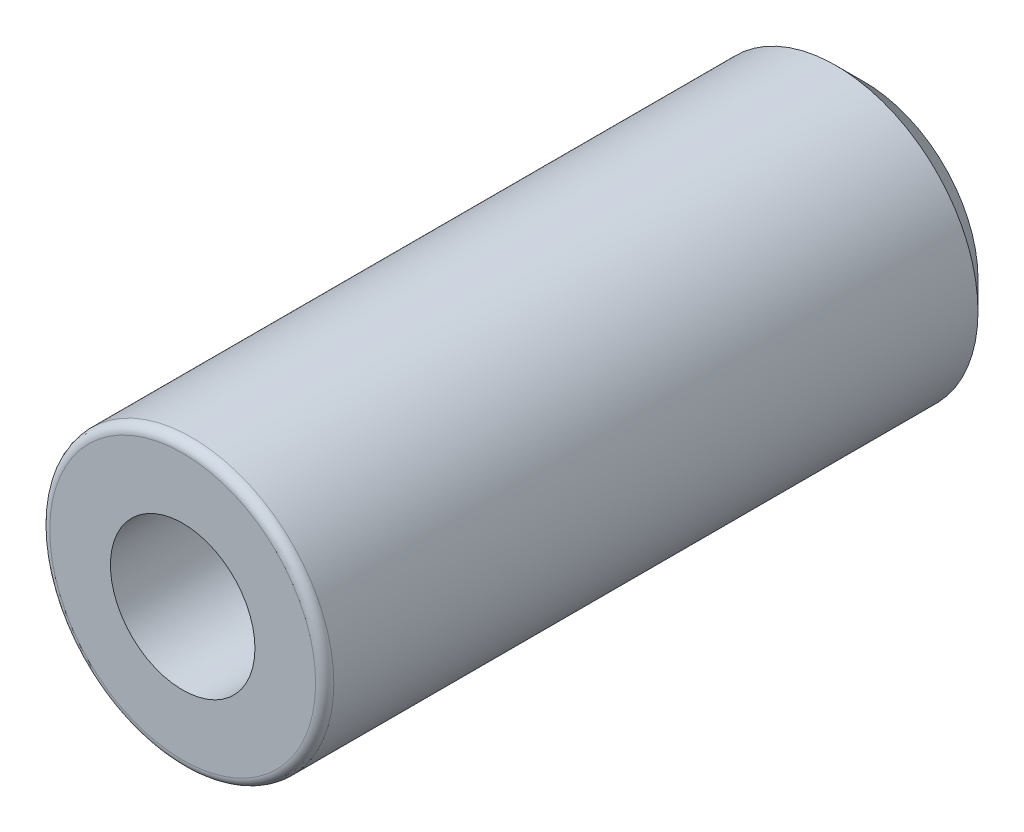
ISO-10303-21;
HEADER;
FILE_DESCRIPTION(('STEP AP214'),'2;1');
FILE_NAME('part.step','',(''),(''),'','','');
FILE_SCHEMA(('AUTOMOTIVE_DESIGN { 1 0 10303 214 1 1 1 1 }'));
ENDSEC;
DATA;
#1=APPLICATION_CONTEXT('core data for automotive mechanical design processes');
#2=APPLICATION_PROTOCOL_DEFINITION('international standard','automotive_design',2000,#1);
#3=PRODUCT_CONTEXT('',#1,'mechanical');
#4=PRODUCT('Part','Part','',(#3));
#5=PRODUCT_RELATED_PRODUCT_CATEGORY('part','',(#4));
#6=PRODUCT_DEFINITION_FORMATION('','',#4);
#7=PRODUCT_DEFINITION_CONTEXT('part definition',#1,'design');
#8=PRODUCT_DEFINITION('design','',#6,#7);
#9=PRODUCT_DEFINITION_SHAPE('','',#8);
#10=(LENGTH_UNIT() NAMED_UNIT(*) SI_UNIT(.MILLI.,.METRE.));
#11=(NAMED_UNIT(*) PLANE_ANGLE_UNIT() SI_UNIT($,.RADIAN.));
#12=(NAMED_UNIT(*) SI_UNIT($,.STERADIAN.) SOLID_ANGLE_UNIT());
#13=UNCERTAINTY_MEASURE_WITH_UNIT(LENGTH_MEASURE(1.E-05),#10,'distance_accuracy_value','');
#14=(GEOMETRIC_REPRESENTATION_CONTEXT(3) GLOBAL_UNCERTAINTY_ASSIGNED_CONTEXT((#13)) GLOBAL_UNIT_ASSIGNED_CONTEXT((#10,
#11,#12)) REPRESENTATION_CONTEXT('',''));
#15=CARTESIAN_POINT('',(0.,0.,0.));
#16=DIRECTION('',(0.,0.,1.));
#17=DIRECTION('',(1.,0.,0.));
#18=AXIS2_PLACEMENT_3D('',#15,#16,#17);
#19=CARTESIAN_POINT('',(0.,0.,9.525));
#20=DIRECTION('',(0.,0.,-1.));
#21=DIRECTION('',(-1.,0.,0.));
#22=AXIS2_PLACEMENT_3D('',#19,#20,#21);
#23=CYLINDRICAL_SURFACE('',#22,3.96875);
#24=CARTESIAN_POINT('',(0.,0.,-8.73124999999999));
#25=DIRECTION('',(0.,0.,1.));
#26=DIRECTION('',(1.,0.,0.));
#27=AXIS2_PLACEMENT_3D('',#24,#25,#26);
#28=CIRCLE('',#27,3.96875);
#29=CARTESIAN_POINT('',(3.96875,0.,-8.73124999999999));
#30=VERTEX_POINT('',#29);
#31=EDGE_CURVE('E45',#30,#30,#28,.T.);
#32=ORIENTED_EDGE('',*,*,#31,.T.);
#33=EDGE_LOOP('',(#32));
#34=FACE_BOUND('',#33,.T.);
#35=CARTESIAN_POINT('',(0.,0.,9.271));
#36=DIRECTION('',(0.,0.,1.));
#37=DIRECTION('',(1.,0.,0.));
#38=AXIS2_PLACEMENT_3D('',#35,#36,#37);
#39=CIRCLE('',#38,3.96875);
#40=CARTESIAN_POINT('',(3.96875,0.,9.271));
#41=VERTEX_POINT('',#40);
#42=EDGE_CURVE('E61',#41,#41,#39,.F.);
#43=ORIENTED_EDGE('',*,*,#42,.T.);
#44=EDGE_LOOP('',(#43));
#45=FACE_BOUND('',#44,.T.);
#46=ADVANCED_FACE('F38',(#34,#45),#23,.T.);
#47=CARTESIAN_POINT('',(0.,0.,9.525));
#48=DIRECTION('',(0.,0.,1.));
#49=DIRECTION('',(1.,0.,0.));
#50=AXIS2_PLACEMENT_3D('',#47,#48,#49);
#51=PLANE('',#50);
#52=CARTESIAN_POINT('',(0.,0.,9.525));
#53=DIRECTION('',(0.,0.,1.));
#54=DIRECTION('',(1.,0.,0.));
#55=AXIS2_PLACEMENT_3D('',#52,#53,#54);
#56=CIRCLE('',#55,2.0193);
#57=CARTESIAN_POINT('',(2.0193,0.,9.525));
#58=VERTEX_POINT('',#57);
#59=EDGE_CURVE('E58',#58,#58,#56,.T.);
#60=ORIENTED_EDGE('',*,*,#59,.F.);
#61=EDGE_LOOP('',(#60));
#62=FACE_BOUND('',#61,.T.);
#63=CARTESIAN_POINT('',(0.,0.,9.525));
#64=DIRECTION('',(0.,0.,1.));
#65=DIRECTION('',(1.,0.,0.));
#66=AXIS2_PLACEMENT_3D('',#63,#64,#65);
#67=CIRCLE('',#66,3.71475);
#68=CARTESIAN_POINT('',(3.71475,0.,9.525));
#69=VERTEX_POINT('',#68);
#70=EDGE_CURVE('E57',#69,#69,#67,.T.);
#71=ORIENTED_EDGE('',*,*,#70,.T.);
#72=EDGE_LOOP('',(#71));
#73=FACE_BOUND('',#72,.T.);
#74=ADVANCED_FACE('F82',(#62,#73),#51,.T.);
#75=CARTESIAN_POINT('',(0.,0.,-9.525));
#76=DIRECTION('',(0.,0.,1.));
#77=DIRECTION('',(1.,0.,0.));
#78=AXIS2_PLACEMENT_3D('',#75,#76,#77);
#79=PLANE('',#78);
#80=CARTESIAN_POINT('',(0.,0.,-9.525));
#81=DIRECTION('',(0.,0.,1.));
#82=DIRECTION('',(1.,0.,0.));
#83=AXIS2_PLACEMENT_3D('',#80,#81,#82);
#84=CIRCLE('',#83,3.17499999999999);
#85=CARTESIAN_POINT('',(3.17499999999999,0.,-9.525));
#86=VERTEX_POINT('',#85);
#87=EDGE_CURVE('E11',#86,#86,#84,.F.);
#88=ORIENTED_EDGE('',*,*,#87,.T.);
#89=EDGE_LOOP('',(#88));
#90=FACE_BOUND('',#89,.T.);
#91=ADVANCED_FACE('F78',(#90),#79,.F.);
#92=CARTESIAN_POINT('',(0.,0.,9.271));
#93=DIRECTION('',(0.,0.,1.));
#94=DIRECTION('',(1.,0.,0.));
#95=AXIS2_PLACEMENT_3D('',#92,#93,#94);
#96=TOROIDAL_SURFACE('',#95,3.71475,0.254);
#97=ORIENTED_EDGE('',*,*,#42,.F.);
#98=EDGE_LOOP('',(#97));
#99=FACE_BOUND('',#98,.T.);
#100=ORIENTED_EDGE('',*,*,#70,.F.);
#101=EDGE_LOOP('',(#100));
#102=FACE_BOUND('',#101,.T.);
#103=ADVANCED_FACE('F73',(#99,#102),#96,.T.);
#104=CARTESIAN_POINT('',(0.,0.,-8.73124999999999));
#105=DIRECTION('',(0.,0.,1.));
#106=DIRECTION('',(1.,0.,0.));
#107=AXIS2_PLACEMENT_3D('',#104,#105,#106);
#108=CONICAL_SURFACE('',#107,3.96875,0.78539816339745);
#109=ORIENTED_EDGE('',*,*,#87,.F.);
#110=EDGE_LOOP('',(#109));
#111=FACE_BOUND('',#110,.T.);
#112=ORIENTED_EDGE('',*,*,#31,.F.);
#113=EDGE_LOOP('',(#112));
#114=FACE_BOUND('',#113,.T.);
#115=ADVANCED_FACE('F40',(#111,#114),#108,.T.);
#116=CARTESIAN_POINT('',(0.,0.,-2.5146));
#117=DIRECTION('',(0.,0.,1.));
#118=DIRECTION('',(1.,0.,0.));
#119=AXIS2_PLACEMENT_3D('',#116,#117,#118);
#120=CONICAL_SURFACE('',#119,2.0193,1.02974425867665);
#121=CARTESIAN_POINT('',(0.,0.,-3.72791784800235));
#122=VERTEX_POINT('',#121);
#123=VERTEX_LOOP('',#122);
#124=FACE_BOUND('',#123,.T.);
#125=CARTESIAN_POINT('',(0.,0.,-2.5146));
#126=DIRECTION('',(0.,0.,1.));
#127=DIRECTION('',(1.,0.,0.));
#128=AXIS2_PLACEMENT_3D('',#125,#126,#127);
#129=CIRCLE('',#128,2.0193);
#130=CARTESIAN_POINT('',(2.0193,0.,-2.5146));
#131=VERTEX_POINT('',#130);
#132=EDGE_CURVE('E55',#131,#131,#129,.T.);
#133=ORIENTED_EDGE('',*,*,#132,.T.);
#134=EDGE_LOOP('',(#133));
#135=FACE_BOUND('',#134,.T.);
#136=ADVANCED_FACE('F48',(#124,#135),#120,.F.);
#137=CARTESIAN_POINT('',(0.,0.,9.525));
#138=DIRECTION('',(0.,0.,1.));
#139=DIRECTION('',(1.,0.,0.));
#140=AXIS2_PLACEMENT_3D('',#137,#138,#139);
#141=CYLINDRICAL_SURFACE('',#140,2.0193);
#142=ORIENTED_EDGE('',*,*,#132,.F.);
#143=EDGE_LOOP('',(#142));
#144=FACE_BOUND('',#143,.T.);
#145=ORIENTED_EDGE('',*,*,#59,.T.);
#146=EDGE_LOOP('',(#145));
#147=FACE_BOUND('',#146,.T.);
#148=ADVANCED_FACE('F51',(#144,#147),#141,.F.);
#149=CLOSED_SHELL('',(#46,#74,#91,#103,#115,#136,#148));
#150=MANIFOLD_SOLID_BREP('B2',#149);
#151=ADVANCED_BREP_SHAPE_REPRESENTATION('',(#18,#150),#14);
#152=SHAPE_DEFINITION_REPRESENTATION(#9,#151);
ENDSEC;
END-ISO-10303-21;
